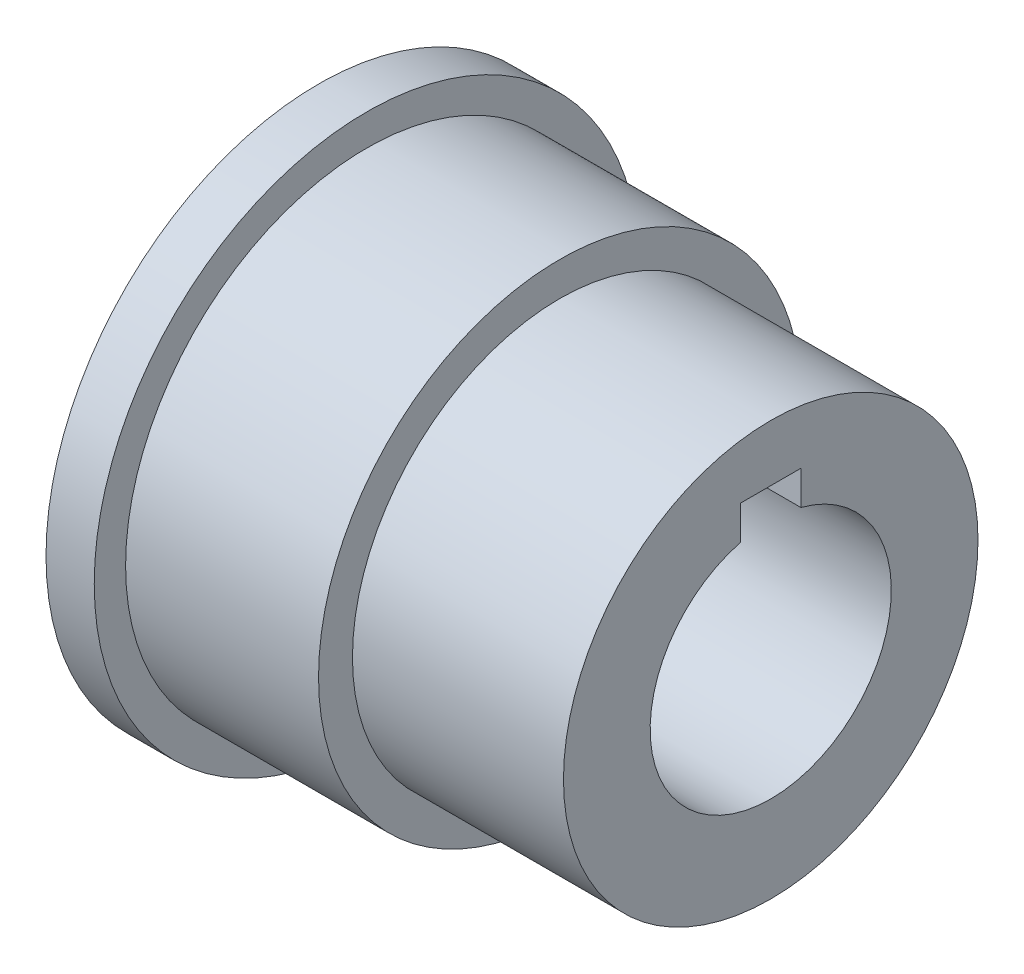
ISO-10303-21;
HEADER;
FILE_DESCRIPTION(('STEP AP214'),'2;1');
FILE_NAME('part.step','',(''),(''),'','','');
FILE_SCHEMA(('AUTOMOTIVE_DESIGN { 1 0 10303 214 1 1 1 1 }'));
ENDSEC;
DATA;
#1=APPLICATION_CONTEXT('core data for automotive mechanical design processes');
#2=APPLICATION_PROTOCOL_DEFINITION('international standard','automotive_design',2000,#1);
#3=PRODUCT_CONTEXT('',#1,'mechanical');
#4=PRODUCT('Part','Part','',(#3));
#5=PRODUCT_RELATED_PRODUCT_CATEGORY('part','',(#4));
#6=PRODUCT_DEFINITION_FORMATION('','',#4);
#7=PRODUCT_DEFINITION_CONTEXT('part definition',#1,'design');
#8=PRODUCT_DEFINITION('design','',#6,#7);
#9=PRODUCT_DEFINITION_SHAPE('','',#8);
#10=(LENGTH_UNIT() NAMED_UNIT(*) SI_UNIT(.MILLI.,.METRE.));
#11=(NAMED_UNIT(*) PLANE_ANGLE_UNIT() SI_UNIT($,.RADIAN.));
#12=(NAMED_UNIT(*) SI_UNIT($,.STERADIAN.) SOLID_ANGLE_UNIT());
#13=UNCERTAINTY_MEASURE_WITH_UNIT(LENGTH_MEASURE(1.E-05),#10,'distance_accuracy_value','');
#14=(GEOMETRIC_REPRESENTATION_CONTEXT(3) GLOBAL_UNCERTAINTY_ASSIGNED_CONTEXT((#13)) GLOBAL_UNIT_ASSIGNED_CONTEXT((#10,
#11,#12)) REPRESENTATION_CONTEXT('',''));
#15=CARTESIAN_POINT('',(0.,0.,0.));
#16=DIRECTION('',(0.,0.,1.));
#17=DIRECTION('',(1.,0.,0.));
#18=AXIS2_PLACEMENT_3D('',#15,#16,#17);
#19=CARTESIAN_POINT('',(12.7,0.,0.));
#20=DIRECTION('',(-1.,0.,0.));
#21=DIRECTION('',(0.,0.,1.));
#22=AXIS2_PLACEMENT_3D('',#19,#20,#21);
#23=CYLINDRICAL_SURFACE('',#22,12.7);
#24=CARTESIAN_POINT('',(12.7,0.,0.));
#25=DIRECTION('',(-1.,0.,0.));
#26=DIRECTION('',(0.,0.,1.));
#27=AXIS2_PLACEMENT_3D('',#24,#25,#26);
#28=CIRCLE('',#27,12.7);
#29=CARTESIAN_POINT('',(12.7,0.,12.7));
#30=VERTEX_POINT('',#29);
#31=EDGE_CURVE('E109',#30,#30,#28,.T.);
#32=ORIENTED_EDGE('',*,*,#31,.T.);
#33=EDGE_LOOP('',(#32));
#34=FACE_BOUND('',#33,.T.);
#35=CARTESIAN_POINT('',(2.54,0.,0.));
#36=DIRECTION('',(-1.,0.,0.));
#37=DIRECTION('',(0.,0.,1.));
#38=AXIS2_PLACEMENT_3D('',#35,#36,#37);
#39=CIRCLE('',#38,12.7);
#40=CARTESIAN_POINT('',(2.54,0.,12.7));
#41=VERTEX_POINT('',#40);
#42=EDGE_CURVE('E163',#41,#41,#39,.T.);
#43=ORIENTED_EDGE('',*,*,#42,.F.);
#44=EDGE_LOOP('',(#43));
#45=FACE_BOUND('',#44,.T.);
#46=ADVANCED_FACE('F34',(#34,#45),#23,.T.);
#47=CARTESIAN_POINT('',(23.8125,0.,0.));
#48=DIRECTION('',(-1.,0.,0.));
#49=DIRECTION('',(0.,0.,1.));
#50=AXIS2_PLACEMENT_3D('',#47,#48,#49);
#51=CYLINDRICAL_SURFACE('',#50,10.9140625);
#52=CARTESIAN_POINT('',(23.8125,0.,0.));
#53=DIRECTION('',(1.,0.,0.));
#54=DIRECTION('',(0.,0.,-1.));
#55=AXIS2_PLACEMENT_3D('',#52,#53,#54);
#56=CIRCLE('',#55,10.9140625);
#57=CARTESIAN_POINT('',(23.8125,0.,-10.9140625));
#58=VERTEX_POINT('',#57);
#59=EDGE_CURVE('E103',#58,#58,#56,.T.);
#60=ORIENTED_EDGE('',*,*,#59,.F.);
#61=EDGE_LOOP('',(#60));
#62=FACE_BOUND('',#61,.T.);
#63=CARTESIAN_POINT('',(12.7,0.,0.));
#64=DIRECTION('',(-1.,0.,0.));
#65=DIRECTION('',(0.,0.,1.));
#66=AXIS2_PLACEMENT_3D('',#63,#64,#65);
#67=CIRCLE('',#66,10.9140625);
#68=CARTESIAN_POINT('',(12.7,0.,10.9140625));
#69=VERTEX_POINT('',#68);
#70=EDGE_CURVE('E11',#69,#69,#67,.T.);
#71=ORIENTED_EDGE('',*,*,#70,.F.);
#72=EDGE_LOOP('',(#71));
#73=FACE_BOUND('',#72,.T.);
#74=ADVANCED_FACE('F130',(#62,#73),#51,.T.);
#75=CARTESIAN_POINT('',(23.8125,0.,0.));
#76=DIRECTION('',(-1.,0.,0.));
#77=DIRECTION('',(0.,0.,1.));
#78=AXIS2_PLACEMENT_3D('',#75,#76,#77);
#79=CYLINDRICAL_SURFACE('',#78,6.35);
#80=CARTESIAN_POINT('',(0.,0.,0.));
#81=DIRECTION('',(1.,0.,0.));
#82=DIRECTION('',(0.,0.,-1.));
#83=AXIS2_PLACEMENT_3D('',#80,#81,#82);
#84=CIRCLE('',#83,6.35);
#85=CARTESIAN_POINT('',(0.,6.14836106210428,1.5875));
#86=VERTEX_POINT('',#85);
#87=CARTESIAN_POINT('',(0.,6.14836106210427,-1.5875));
#88=VERTEX_POINT('',#87);
#89=EDGE_CURVE('E106',#86,#88,#84,.T.);
#90=ORIENTED_EDGE('',*,*,#89,.F.);
#91=DIRECTION('',(-1.,0.,0.));
#92=VECTOR('',#91,1.);
#93=CARTESIAN_POINT('',(23.8125,6.14836106210428,1.5875));
#94=LINE('',#93,#92);
#95=CARTESIAN_POINT('',(23.8125,6.14836106210428,1.5875));
#96=VERTEX_POINT('',#95);
#97=EDGE_CURVE('E43',#96,#86,#94,.T.);
#98=ORIENTED_EDGE('',*,*,#97,.F.);
#99=CARTESIAN_POINT('',(23.8125,0.,0.));
#100=DIRECTION('',(1.,0.,0.));
#101=DIRECTION('',(0.,0.,-1.));
#102=AXIS2_PLACEMENT_3D('',#99,#100,#101);
#103=CIRCLE('',#102,6.35);
#104=CARTESIAN_POINT('',(23.8125,6.14836106210427,-1.5875));
#105=VERTEX_POINT('',#104);
#106=EDGE_CURVE('E96',#96,#105,#103,.T.);
#107=ORIENTED_EDGE('',*,*,#106,.T.);
#108=DIRECTION('',(-1.,0.,0.));
#109=VECTOR('',#108,1.);
#110=CARTESIAN_POINT('',(23.8125,6.14836106210427,-1.5875));
#111=LINE('',#110,#109);
#112=EDGE_CURVE('E74',#105,#88,#111,.T.);
#113=ORIENTED_EDGE('',*,*,#112,.T.);
#114=EDGE_LOOP('',(#90,#98,#107,#113));
#115=FACE_BOUND('',#114,.T.);
#116=ADVANCED_FACE('F36',(#115),#79,.F.);
#117=CARTESIAN_POINT('',(23.8125,0.,1.5875));
#118=DIRECTION('',(0.,0.,-1.));
#119=DIRECTION('',(0.,1.,0.));
#120=AXIS2_PLACEMENT_3D('',#117,#118,#119);
#121=PLANE('',#120);
#122=DIRECTION('',(0.,-1.,0.));
#123=VECTOR('',#122,1.);
#124=CARTESIAN_POINT('',(0.,0.,1.5875));
#125=LINE('',#124,#123);
#126=CARTESIAN_POINT('',(0.,7.9375,1.5875));
#127=VERTEX_POINT('',#126);
#128=EDGE_CURVE('E88',#127,#86,#125,.T.);
#129=ORIENTED_EDGE('',*,*,#128,.F.);
#130=DIRECTION('',(-1.,0.,0.));
#131=VECTOR('',#130,1.);
#132=CARTESIAN_POINT('',(23.8125,7.9375,1.5875));
#133=LINE('',#132,#131);
#134=CARTESIAN_POINT('',(23.8125,7.9375,1.5875));
#135=VERTEX_POINT('',#134);
#136=EDGE_CURVE('E82',#135,#127,#133,.T.);
#137=ORIENTED_EDGE('',*,*,#136,.F.);
#138=DIRECTION('',(0.,-1.,0.));
#139=VECTOR('',#138,1.);
#140=CARTESIAN_POINT('',(23.8125,0.,1.5875));
#141=LINE('',#140,#139);
#142=EDGE_CURVE('E86',#135,#96,#141,.T.);
#143=ORIENTED_EDGE('',*,*,#142,.T.);
#144=ORIENTED_EDGE('',*,*,#97,.T.);
#145=EDGE_LOOP('',(#129,#137,#143,#144));
#146=FACE_BOUND('',#145,.T.);
#147=ADVANCED_FACE('F84',(#146),#121,.T.);
#148=CARTESIAN_POINT('',(23.8125,7.9375,0.));
#149=DIRECTION('',(0.,1.,0.));
#150=DIRECTION('',(0.,0.,1.));
#151=AXIS2_PLACEMENT_3D('',#148,#149,#150);
#152=PLANE('',#151);
#153=DIRECTION('',(0.,0.,-1.));
#154=VECTOR('',#153,1.);
#155=CARTESIAN_POINT('',(0.,7.9375,0.));
#156=LINE('',#155,#154);
#157=CARTESIAN_POINT('',(0.,7.9375,-1.5875));
#158=VERTEX_POINT('',#157);
#159=EDGE_CURVE('E67',#127,#158,#156,.T.);
#160=ORIENTED_EDGE('',*,*,#159,.T.);
#161=DIRECTION('',(-1.,0.,0.));
#162=VECTOR('',#161,1.);
#163=CARTESIAN_POINT('',(23.8125,7.9375,-1.5875));
#164=LINE('',#163,#162);
#165=CARTESIAN_POINT('',(23.8125,7.9375,-1.5875));
#166=VERTEX_POINT('',#165);
#167=EDGE_CURVE('E89',#166,#158,#164,.T.);
#168=ORIENTED_EDGE('',*,*,#167,.F.);
#169=DIRECTION('',(0.,0.,-1.));
#170=VECTOR('',#169,1.);
#171=CARTESIAN_POINT('',(23.8125,7.9375,0.));
#172=LINE('',#171,#170);
#173=EDGE_CURVE('E91',#135,#166,#172,.T.);
#174=ORIENTED_EDGE('',*,*,#173,.F.);
#175=ORIENTED_EDGE('',*,*,#136,.T.);
#176=EDGE_LOOP('',(#160,#168,#174,#175));
#177=FACE_BOUND('',#176,.T.);
#178=ADVANCED_FACE('F92',(#177),#152,.F.);
#179=CARTESIAN_POINT('',(23.8125,0.,-1.5875));
#180=DIRECTION('',(0.,0.,-1.));
#181=DIRECTION('',(0.,1.,0.));
#182=AXIS2_PLACEMENT_3D('',#179,#180,#181);
#183=PLANE('',#182);
#184=DIRECTION('',(0.,-1.,0.));
#185=VECTOR('',#184,1.);
#186=CARTESIAN_POINT('',(0.,0.,-1.5875));
#187=LINE('',#186,#185);
#188=EDGE_CURVE('E98',#158,#88,#187,.T.);
#189=ORIENTED_EDGE('',*,*,#188,.T.);
#190=ORIENTED_EDGE('',*,*,#112,.F.);
#191=DIRECTION('',(0.,-1.,0.));
#192=VECTOR('',#191,1.);
#193=CARTESIAN_POINT('',(23.8125,0.,-1.5875));
#194=LINE('',#193,#192);
#195=EDGE_CURVE('E51',#166,#105,#194,.T.);
#196=ORIENTED_EDGE('',*,*,#195,.F.);
#197=ORIENTED_EDGE('',*,*,#167,.T.);
#198=EDGE_LOOP('',(#189,#190,#196,#197));
#199=FACE_BOUND('',#198,.T.);
#200=ADVANCED_FACE('F119',(#199),#183,.F.);
#201=CARTESIAN_POINT('',(23.8125,0.,0.));
#202=DIRECTION('',(1.,0.,0.));
#203=DIRECTION('',(0.,0.,-1.));
#204=AXIS2_PLACEMENT_3D('',#201,#202,#203);
#205=PLANE('',#204);
#206=ORIENTED_EDGE('',*,*,#106,.F.);
#207=ORIENTED_EDGE('',*,*,#142,.F.);
#208=ORIENTED_EDGE('',*,*,#173,.T.);
#209=ORIENTED_EDGE('',*,*,#195,.T.);
#210=EDGE_LOOP('',(#206,#207,#208,#209));
#211=FACE_BOUND('',#210,.T.);
#212=ORIENTED_EDGE('',*,*,#59,.T.);
#213=EDGE_LOOP('',(#212));
#214=FACE_BOUND('',#213,.T.);
#215=ADVANCED_FACE('F94',(#211,#214),#205,.T.);
#216=CARTESIAN_POINT('',(0.,0.,0.));
#217=DIRECTION('',(1.,0.,0.));
#218=DIRECTION('',(0.,0.,-1.));
#219=AXIS2_PLACEMENT_3D('',#216,#217,#218);
#220=PLANE('',#219);
#221=ORIENTED_EDGE('',*,*,#89,.T.);
#222=ORIENTED_EDGE('',*,*,#188,.F.);
#223=ORIENTED_EDGE('',*,*,#159,.F.);
#224=ORIENTED_EDGE('',*,*,#128,.T.);
#225=EDGE_LOOP('',(#221,#222,#223,#224));
#226=FACE_BOUND('',#225,.T.);
#227=CARTESIAN_POINT('',(0.,0.,0.));
#228=DIRECTION('',(-1.,0.,0.));
#229=DIRECTION('',(0.,0.,1.));
#230=AXIS2_PLACEMENT_3D('',#227,#228,#229);
#231=CIRCLE('',#230,14.351);
#232=CARTESIAN_POINT('',(0.,0.,14.351));
#233=VERTEX_POINT('',#232);
#234=EDGE_CURVE('E159',#233,#233,#231,.T.);
#235=ORIENTED_EDGE('',*,*,#234,.T.);
#236=EDGE_LOOP('',(#235));
#237=FACE_BOUND('',#236,.T.);
#238=ADVANCED_FACE('F116',(#226,#237),#220,.F.);
#239=CARTESIAN_POINT('',(12.7,0.,0.));
#240=DIRECTION('',(-1.,0.,0.));
#241=DIRECTION('',(0.,0.,1.));
#242=AXIS2_PLACEMENT_3D('',#239,#240,#241);
#243=PLANE('',#242);
#244=ORIENTED_EDGE('',*,*,#70,.T.);
#245=EDGE_LOOP('',(#244));
#246=FACE_BOUND('',#245,.T.);
#247=ORIENTED_EDGE('',*,*,#31,.F.);
#248=EDGE_LOOP('',(#247));
#249=FACE_BOUND('',#248,.T.);
#250=ADVANCED_FACE('F140',(#246,#249),#243,.F.);
#251=CARTESIAN_POINT('',(2.54,0.,0.));
#252=DIRECTION('',(-1.,0.,0.));
#253=DIRECTION('',(0.,0.,1.));
#254=AXIS2_PLACEMENT_3D('',#251,#252,#253);
#255=CYLINDRICAL_SURFACE('',#254,14.351);
#256=CARTESIAN_POINT('',(2.54,0.,0.));
#257=DIRECTION('',(-1.,0.,0.));
#258=DIRECTION('',(0.,0.,1.));
#259=AXIS2_PLACEMENT_3D('',#256,#257,#258);
#260=CIRCLE('',#259,14.351);
#261=CARTESIAN_POINT('',(2.54,0.,14.351));
#262=VERTEX_POINT('',#261);
#263=EDGE_CURVE('E157',#262,#262,#260,.T.);
#264=ORIENTED_EDGE('',*,*,#263,.T.);
#265=EDGE_LOOP('',(#264));
#266=FACE_BOUND('',#265,.T.);
#267=ORIENTED_EDGE('',*,*,#234,.F.);
#268=EDGE_LOOP('',(#267));
#269=FACE_BOUND('',#268,.T.);
#270=ADVANCED_FACE('F147',(#266,#269),#255,.T.);
#271=CARTESIAN_POINT('',(2.54,0.,0.));
#272=DIRECTION('',(-1.,0.,0.));
#273=DIRECTION('',(0.,0.,1.));
#274=AXIS2_PLACEMENT_3D('',#271,#272,#273);
#275=PLANE('',#274);
#276=ORIENTED_EDGE('',*,*,#42,.T.);
#277=EDGE_LOOP('',(#276));
#278=FACE_BOUND('',#277,.T.);
#279=ORIENTED_EDGE('',*,*,#263,.F.);
#280=EDGE_LOOP('',(#279));
#281=FACE_BOUND('',#280,.T.);
#282=ADVANCED_FACE('F152',(#278,#281),#275,.F.);
#283=CLOSED_SHELL('',(#46,#74,#116,#147,#178,#200,#215,#238,#250,#270,#282));
#284=MANIFOLD_SOLID_BREP('B2',#283);
#285=ADVANCED_BREP_SHAPE_REPRESENTATION('',(#18,#284),#14);
#286=SHAPE_DEFINITION_REPRESENTATION(#9,#285);
ENDSEC;
END-ISO-10303-21;
